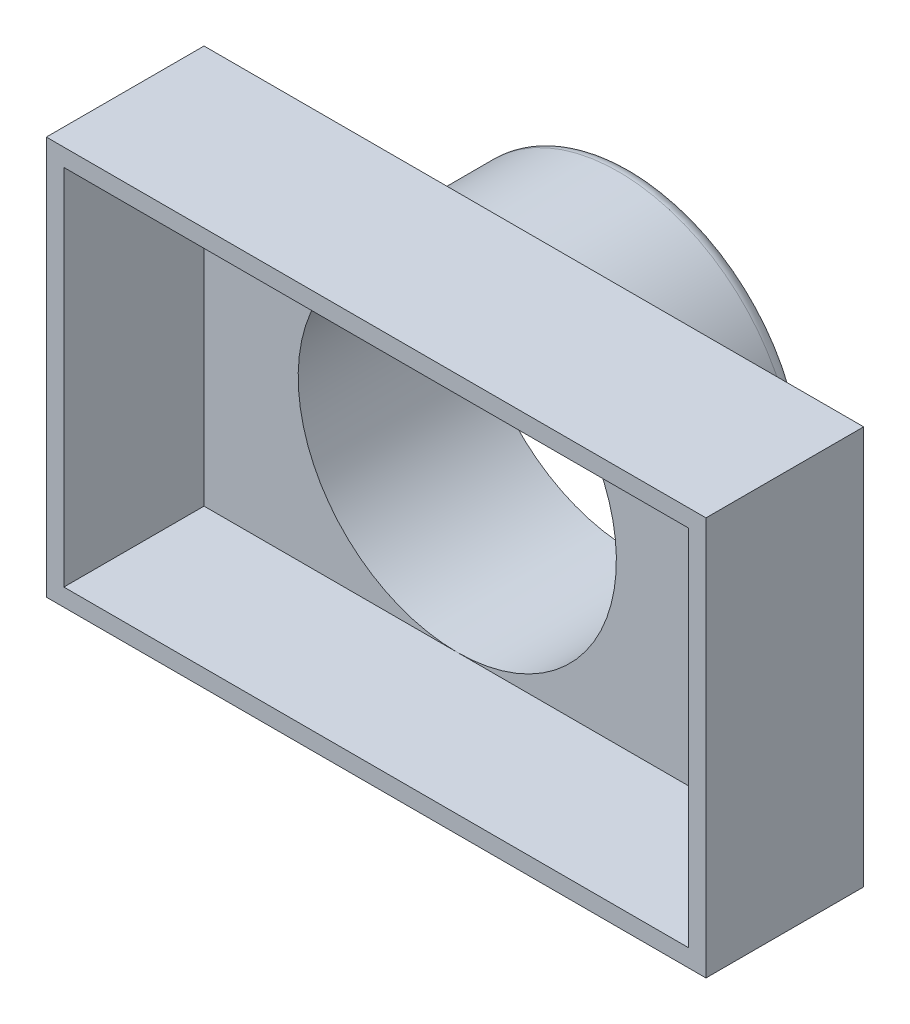
ISO-10303-21;
HEADER;
FILE_DESCRIPTION(('STEP AP214'),'2;1');
FILE_NAME('part.step','',(''),(''),'','','');
FILE_SCHEMA(('AUTOMOTIVE_DESIGN { 1 0 10303 214 1 1 1 1 }'));
ENDSEC;
DATA;
#1=APPLICATION_CONTEXT('core data for automotive mechanical design processes');
#2=APPLICATION_PROTOCOL_DEFINITION('international standard','automotive_design',2000,#1);
#3=PRODUCT_CONTEXT('',#1,'mechanical');
#4=PRODUCT('Part','Part','',(#3));
#5=PRODUCT_RELATED_PRODUCT_CATEGORY('part','',(#4));
#6=PRODUCT_DEFINITION_FORMATION('','',#4);
#7=PRODUCT_DEFINITION_CONTEXT('part definition',#1,'design');
#8=PRODUCT_DEFINITION('design','',#6,#7);
#9=PRODUCT_DEFINITION_SHAPE('','',#8);
#10=(LENGTH_UNIT() NAMED_UNIT(*) SI_UNIT(.MILLI.,.METRE.));
#11=(NAMED_UNIT(*) PLANE_ANGLE_UNIT() SI_UNIT($,.RADIAN.));
#12=(NAMED_UNIT(*) SI_UNIT($,.STERADIAN.) SOLID_ANGLE_UNIT());
#13=UNCERTAINTY_MEASURE_WITH_UNIT(LENGTH_MEASURE(1.E-05),#10,'distance_accuracy_value','');
#14=(GEOMETRIC_REPRESENTATION_CONTEXT(3) GLOBAL_UNCERTAINTY_ASSIGNED_CONTEXT((#13)) GLOBAL_UNIT_ASSIGNED_CONTEXT((#10,
#11,#12)) REPRESENTATION_CONTEXT('',''));
#15=CARTESIAN_POINT('',(0.,0.,0.));
#16=DIRECTION('',(0.,0.,1.));
#17=DIRECTION('',(1.,0.,0.));
#18=AXIS2_PLACEMENT_3D('',#15,#16,#17);
#19=CARTESIAN_POINT('',(0.,0.,-28.575));
#20=DIRECTION('',(0.,0.,-1.));
#21=DIRECTION('',(-1.,0.,0.));
#22=AXIS2_PLACEMENT_3D('',#19,#20,#21);
#23=PLANE('',#22);
#24=DIRECTION('',(-1.,0.,0.));
#25=VECTOR('',#24,1.);
#26=CARTESIAN_POINT('',(0.,-35.30854,-28.575));
#27=LINE('',#26,#25);
#28=CARTESIAN_POINT('',(59.75985,-35.30854,-28.575));
#29=VERTEX_POINT('',#28);
#30=CARTESIAN_POINT('',(12.662727608336,-35.30854,-28.575));
#31=VERTEX_POINT('',#30);
#32=EDGE_CURVE('E132',#29,#31,#27,.T.);
#33=ORIENTED_EDGE('',*,*,#32,.T.);
#34=CARTESIAN_POINT('',(-10.69975,-3.30453999999999,-28.575));
#35=DIRECTION('',(0.,0.,-1.));
#36=DIRECTION('',(-1.,0.,0.));
#37=AXIS2_PLACEMENT_3D('',#34,#35,#36);
#38=CIRCLE('',#37,39.624);
#39=CARTESIAN_POINT('',(-34.062227608336,-35.30854,-28.575));
#40=VERTEX_POINT('',#39);
#41=EDGE_CURVE('E198',#31,#40,#38,.F.);
#42=ORIENTED_EDGE('',*,*,#41,.T.);
#43=CARTESIAN_POINT('',(-59.75985,-35.30854,-28.575));
#44=VERTEX_POINT('',#43);
#45=EDGE_CURVE('E140',#40,#44,#27,.T.);
#46=ORIENTED_EDGE('',*,*,#45,.T.);
#47=DIRECTION('',(0.,1.,0.));
#48=VECTOR('',#47,1.);
#49=CARTESIAN_POINT('',(-59.75985,0.,-28.575));
#50=LINE('',#49,#48);
#51=CARTESIAN_POINT('',(-59.75985,36.89604,-28.575));
#52=VERTEX_POINT('',#51);
#53=EDGE_CURVE('E138',#44,#52,#50,.T.);
#54=ORIENTED_EDGE('',*,*,#53,.T.);
#55=DIRECTION('',(1.,0.,0.));
#56=VECTOR('',#55,1.);
#57=CARTESIAN_POINT('',(0.,36.89604,-28.575));
#58=LINE('',#57,#56);
#59=CARTESIAN_POINT('',(59.75985,36.89604,-28.575));
#60=VERTEX_POINT('',#59);
#61=EDGE_CURVE('E145',#52,#60,#58,.T.);
#62=ORIENTED_EDGE('',*,*,#61,.T.);
#63=DIRECTION('',(0.,-1.,0.));
#64=VECTOR('',#63,1.);
#65=CARTESIAN_POINT('',(59.75985,0.,-28.575));
#66=LINE('',#65,#64);
#67=EDGE_CURVE('E121',#60,#29,#66,.T.);
#68=ORIENTED_EDGE('',*,*,#67,.T.);
#69=EDGE_LOOP('',(#33,#42,#46,#54,#62,#68));
#70=FACE_BOUND('',#69,.T.);
#71=ADVANCED_FACE('F35',(#70),#23,.T.);
#72=CARTESIAN_POINT('',(-59.75985,36.89604,-25.4));
#73=DIRECTION('',(-1.,0.,0.));
#74=DIRECTION('',(0.,-1.,0.));
#75=AXIS2_PLACEMENT_3D('',#72,#73,#74);
#76=PLANE('',#75);
#77=DIRECTION('',(0.,-1.,0.));
#78=VECTOR('',#77,1.);
#79=CARTESIAN_POINT('',(-59.75985,36.89604,0.));
#80=LINE('',#79,#78);
#81=CARTESIAN_POINT('',(-59.75985,36.89604,0.));
#82=VERTEX_POINT('',#81);
#83=CARTESIAN_POINT('',(-59.75985,-35.30854,0.));
#84=VERTEX_POINT('',#83);
#85=EDGE_CURVE('E181',#82,#84,#80,.T.);
#86=ORIENTED_EDGE('',*,*,#85,.F.);
#87=DIRECTION('',(0.,0.,1.));
#88=VECTOR('',#87,1.);
#89=CARTESIAN_POINT('',(-59.75985,36.89604,-25.4));
#90=LINE('',#89,#88);
#91=EDGE_CURVE('E196',#52,#82,#90,.T.);
#92=ORIENTED_EDGE('',*,*,#91,.F.);
#93=ORIENTED_EDGE('',*,*,#53,.F.);
#94=DIRECTION('',(0.,0.,1.));
#95=VECTOR('',#94,1.);
#96=CARTESIAN_POINT('',(-59.75985,-35.30854,-25.4));
#97=LINE('',#96,#95);
#98=EDGE_CURVE('E128',#44,#84,#97,.T.);
#99=ORIENTED_EDGE('',*,*,#98,.T.);
#100=EDGE_LOOP('',(#86,#92,#93,#99));
#101=FACE_BOUND('',#100,.T.);
#102=ADVANCED_FACE('F218',(#101),#76,.T.);
#103=CARTESIAN_POINT('',(-59.75985,36.89604,-25.4));
#104=DIRECTION('',(0.,1.,0.));
#105=DIRECTION('',(0.,0.,1.));
#106=AXIS2_PLACEMENT_3D('',#103,#104,#105);
#107=PLANE('',#106);
#108=DIRECTION('',(-1.,0.,0.));
#109=VECTOR('',#108,1.);
#110=CARTESIAN_POINT('',(-59.75985,36.89604,0.));
#111=LINE('',#110,#109);
#112=CARTESIAN_POINT('',(59.75985,36.89604,0.));
#113=VERTEX_POINT('',#112);
#114=EDGE_CURVE('E193',#113,#82,#111,.T.);
#115=ORIENTED_EDGE('',*,*,#114,.F.);
#116=DIRECTION('',(0.,0.,1.));
#117=VECTOR('',#116,1.);
#118=CARTESIAN_POINT('',(59.75985,36.89604,-25.4));
#119=LINE('',#118,#117);
#120=EDGE_CURVE('E127',#60,#113,#119,.T.);
#121=ORIENTED_EDGE('',*,*,#120,.F.);
#122=ORIENTED_EDGE('',*,*,#61,.F.);
#123=ORIENTED_EDGE('',*,*,#91,.T.);
#124=EDGE_LOOP('',(#115,#121,#122,#123));
#125=FACE_BOUND('',#124,.T.);
#126=ADVANCED_FACE('F287',(#125),#107,.T.);
#127=CARTESIAN_POINT('',(59.75985,36.89604,-25.4));
#128=DIRECTION('',(1.,0.,0.));
#129=DIRECTION('',(0.,1.,0.));
#130=AXIS2_PLACEMENT_3D('',#127,#128,#129);
#131=PLANE('',#130);
#132=DIRECTION('',(0.,1.,0.));
#133=VECTOR('',#132,1.);
#134=CARTESIAN_POINT('',(59.75985,36.89604,0.));
#135=LINE('',#134,#133);
#136=CARTESIAN_POINT('',(59.75985,-35.30854,0.));
#137=VERTEX_POINT('',#136);
#138=EDGE_CURVE('E123',#137,#113,#135,.T.);
#139=ORIENTED_EDGE('',*,*,#138,.F.);
#140=DIRECTION('',(0.,0.,1.));
#141=VECTOR('',#140,1.);
#142=CARTESIAN_POINT('',(59.75985,-35.30854,-25.4));
#143=LINE('',#142,#141);
#144=EDGE_CURVE('E117',#29,#137,#143,.T.);
#145=ORIENTED_EDGE('',*,*,#144,.F.);
#146=ORIENTED_EDGE('',*,*,#67,.F.);
#147=ORIENTED_EDGE('',*,*,#120,.T.);
#148=EDGE_LOOP('',(#139,#145,#146,#147));
#149=FACE_BOUND('',#148,.T.);
#150=ADVANCED_FACE('F119',(#149),#131,.T.);
#151=CARTESIAN_POINT('',(-59.75985,-35.30854,-25.4));
#152=DIRECTION('',(0.,-1.,0.));
#153=DIRECTION('',(1.,0.,0.));
#154=AXIS2_PLACEMENT_3D('',#151,#152,#153);
#155=PLANE('',#154);
#156=CARTESIAN_POINT('',(-10.69975,-35.30854,-28.575));
#157=VERTEX_POINT('',#156);
#158=EDGE_CURVE('E141',#157,#40,#27,.T.);
#159=ORIENTED_EDGE('',*,*,#158,.F.);
#160=EDGE_CURVE('E136',#31,#157,#27,.T.);
#161=ORIENTED_EDGE('',*,*,#160,.F.);
#162=ORIENTED_EDGE('',*,*,#32,.F.);
#163=ORIENTED_EDGE('',*,*,#144,.T.);
#164=DIRECTION('',(1.,0.,0.));
#165=VECTOR('',#164,1.);
#166=CARTESIAN_POINT('',(-59.75985,-35.30854,0.));
#167=LINE('',#166,#165);
#168=EDGE_CURVE('E190',#84,#137,#167,.T.);
#169=ORIENTED_EDGE('',*,*,#168,.F.);
#170=ORIENTED_EDGE('',*,*,#98,.F.);
#171=ORIENTED_EDGE('',*,*,#45,.F.);
#172=EDGE_LOOP('',(#159,#161,#162,#163,#169,#170,#171));
#173=FACE_BOUND('',#172,.T.);
#174=ADVANCED_FACE('F134',(#173),#155,.T.);
#175=CARTESIAN_POINT('',(0.,0.,0.));
#176=DIRECTION('',(0.,0.,1.));
#177=DIRECTION('',(1.,0.,0.));
#178=AXIS2_PLACEMENT_3D('',#175,#176,#177);
#179=PLANE('',#178);
#180=DIRECTION('',(0.,1.,0.));
#181=VECTOR('',#180,1.);
#182=CARTESIAN_POINT('',(56.58485,33.72104,0.));
#183=LINE('',#182,#181);
#184=CARTESIAN_POINT('',(56.58485,-32.13354,0.));
#185=VERTEX_POINT('',#184);
#186=CARTESIAN_POINT('',(56.58485,33.72104,0.));
#187=VERTEX_POINT('',#186);
#188=EDGE_CURVE('E154',#185,#187,#183,.T.);
#189=ORIENTED_EDGE('',*,*,#188,.F.);
#190=DIRECTION('',(1.,0.,0.));
#191=VECTOR('',#190,1.);
#192=CARTESIAN_POINT('',(-56.58485,-32.13354,0.));
#193=LINE('',#192,#191);
#194=CARTESIAN_POINT('',(-56.58485,-32.13354,0.));
#195=VERTEX_POINT('',#194);
#196=EDGE_CURVE('E160',#195,#185,#193,.T.);
#197=ORIENTED_EDGE('',*,*,#196,.F.);
#198=DIRECTION('',(0.,-1.,0.));
#199=VECTOR('',#198,1.);
#200=CARTESIAN_POINT('',(-56.58485,33.72104,0.));
#201=LINE('',#200,#199);
#202=CARTESIAN_POINT('',(-56.58485,33.72104,0.));
#203=VERTEX_POINT('',#202);
#204=EDGE_CURVE('E174',#203,#195,#201,.T.);
#205=ORIENTED_EDGE('',*,*,#204,.F.);
#206=DIRECTION('',(-1.,0.,0.));
#207=VECTOR('',#206,1.);
#208=CARTESIAN_POINT('',(-56.58485,33.72104,0.));
#209=LINE('',#208,#207);
#210=EDGE_CURVE('E171',#187,#203,#209,.T.);
#211=ORIENTED_EDGE('',*,*,#210,.F.);
#212=EDGE_LOOP('',(#189,#197,#205,#211));
#213=FACE_BOUND('',#212,.T.);
#214=ORIENTED_EDGE('',*,*,#85,.T.);
#215=ORIENTED_EDGE('',*,*,#168,.T.);
#216=ORIENTED_EDGE('',*,*,#138,.T.);
#217=ORIENTED_EDGE('',*,*,#114,.T.);
#218=EDGE_LOOP('',(#214,#215,#216,#217));
#219=FACE_BOUND('',#218,.T.);
#220=ADVANCED_FACE('F314',(#213,#219),#179,.T.);
#221=CARTESIAN_POINT('',(56.58485,33.72104,-25.4));
#222=DIRECTION('',(1.,0.,0.));
#223=DIRECTION('',(0.,1.,0.));
#224=AXIS2_PLACEMENT_3D('',#221,#222,#223);
#225=PLANE('',#224);
#226=ORIENTED_EDGE('',*,*,#188,.T.);
#227=DIRECTION('',(0.,0.,1.));
#228=VECTOR('',#227,1.);
#229=CARTESIAN_POINT('',(56.58485,33.72104,-25.4));
#230=LINE('',#229,#228);
#231=CARTESIAN_POINT('',(56.58485,33.72104,-25.4));
#232=VERTEX_POINT('',#231);
#233=EDGE_CURVE('E169',#232,#187,#230,.T.);
#234=ORIENTED_EDGE('',*,*,#233,.F.);
#235=DIRECTION('',(0.,1.,0.));
#236=VECTOR('',#235,1.);
#237=CARTESIAN_POINT('',(56.58485,33.72104,-25.4));
#238=LINE('',#237,#236);
#239=CARTESIAN_POINT('',(56.58485,-32.13354,-25.4));
#240=VERTEX_POINT('',#239);
#241=EDGE_CURVE('E156',#240,#232,#238,.T.);
#242=ORIENTED_EDGE('',*,*,#241,.F.);
#243=DIRECTION('',(0.,0.,1.));
#244=VECTOR('',#243,1.);
#245=CARTESIAN_POINT('',(56.58485,-32.13354,-25.4));
#246=LINE('',#245,#244);
#247=EDGE_CURVE('E179',#240,#185,#246,.T.);
#248=ORIENTED_EDGE('',*,*,#247,.T.);
#249=EDGE_LOOP('',(#226,#234,#242,#248));
#250=FACE_BOUND('',#249,.T.);
#251=ADVANCED_FACE('F304',(#250),#225,.F.);
#252=CARTESIAN_POINT('',(-56.58485,-32.13354,-25.4));
#253=DIRECTION('',(0.,-1.,0.));
#254=DIRECTION('',(0.,0.,-1.));
#255=AXIS2_PLACEMENT_3D('',#252,#253,#254);
#256=PLANE('',#255);
#257=ORIENTED_EDGE('',*,*,#196,.T.);
#258=ORIENTED_EDGE('',*,*,#247,.F.);
#259=DIRECTION('',(1.,0.,0.));
#260=VECTOR('',#259,1.);
#261=CARTESIAN_POINT('',(-56.58485,-32.13354,-25.4));
#262=LINE('',#261,#260);
#263=CARTESIAN_POINT('',(-10.69975,-32.13354,-25.4));
#264=VERTEX_POINT('',#263);
#265=EDGE_CURVE('E166',#264,#240,#262,.T.);
#266=ORIENTED_EDGE('',*,*,#265,.F.);
#267=CARTESIAN_POINT('',(-56.58485,-32.13354,-25.4));
#268=VERTEX_POINT('',#267);
#269=EDGE_CURVE('E167',#268,#264,#262,.T.);
#270=ORIENTED_EDGE('',*,*,#269,.F.);
#271=DIRECTION('',(0.,0.,1.));
#272=VECTOR('',#271,1.);
#273=CARTESIAN_POINT('',(-56.58485,-32.13354,-25.4));
#274=LINE('',#273,#272);
#275=EDGE_CURVE('E182',#268,#195,#274,.T.);
#276=ORIENTED_EDGE('',*,*,#275,.T.);
#277=EDGE_LOOP('',(#257,#258,#266,#270,#276));
#278=FACE_BOUND('',#277,.T.);
#279=ADVANCED_FACE('F300',(#278),#256,.F.);
#280=CARTESIAN_POINT('',(-56.58485,33.72104,-25.4));
#281=DIRECTION('',(-1.,0.,0.));
#282=DIRECTION('',(0.,-1.,0.));
#283=AXIS2_PLACEMENT_3D('',#280,#281,#282);
#284=PLANE('',#283);
#285=ORIENTED_EDGE('',*,*,#204,.T.);
#286=ORIENTED_EDGE('',*,*,#275,.F.);
#287=DIRECTION('',(0.,-1.,0.));
#288=VECTOR('',#287,1.);
#289=CARTESIAN_POINT('',(-56.58485,33.72104,-25.4));
#290=LINE('',#289,#288);
#291=CARTESIAN_POINT('',(-56.58485,33.72104,-25.4));
#292=VERTEX_POINT('',#291);
#293=EDGE_CURVE('E163',#292,#268,#290,.T.);
#294=ORIENTED_EDGE('',*,*,#293,.F.);
#295=DIRECTION('',(0.,0.,1.));
#296=VECTOR('',#295,1.);
#297=CARTESIAN_POINT('',(-56.58485,33.72104,-25.4));
#298=LINE('',#297,#296);
#299=EDGE_CURVE('E184',#292,#203,#298,.T.);
#300=ORIENTED_EDGE('',*,*,#299,.T.);
#301=EDGE_LOOP('',(#285,#286,#294,#300));
#302=FACE_BOUND('',#301,.T.);
#303=ADVANCED_FACE('F303',(#302),#284,.F.);
#304=CARTESIAN_POINT('',(-56.58485,33.72104,-25.4));
#305=DIRECTION('',(0.,1.,0.));
#306=DIRECTION('',(0.,0.,1.));
#307=AXIS2_PLACEMENT_3D('',#304,#305,#306);
#308=PLANE('',#307);
#309=ORIENTED_EDGE('',*,*,#210,.T.);
#310=ORIENTED_EDGE('',*,*,#299,.F.);
#311=DIRECTION('',(-1.,0.,0.));
#312=VECTOR('',#311,1.);
#313=CARTESIAN_POINT('',(-56.58485,33.72104,-25.4));
#314=LINE('',#313,#312);
#315=EDGE_CURVE('E159',#232,#292,#314,.T.);
#316=ORIENTED_EDGE('',*,*,#315,.F.);
#317=ORIENTED_EDGE('',*,*,#233,.T.);
#318=EDGE_LOOP('',(#309,#310,#316,#317));
#319=FACE_BOUND('',#318,.T.);
#320=ADVANCED_FACE('F295',(#319),#308,.F.);
#321=CARTESIAN_POINT('',(0.,0.,-25.4));
#322=DIRECTION('',(0.,0.,-1.));
#323=DIRECTION('',(-1.,0.,0.));
#324=AXIS2_PLACEMENT_3D('',#321,#322,#323);
#325=PLANE('',#324);
#326=ORIENTED_EDGE('',*,*,#265,.T.);
#327=ORIENTED_EDGE('',*,*,#241,.T.);
#328=ORIENTED_EDGE('',*,*,#315,.T.);
#329=ORIENTED_EDGE('',*,*,#293,.T.);
#330=ORIENTED_EDGE('',*,*,#269,.T.);
#331=CARTESIAN_POINT('',(-10.69975,-3.30453999999999,-25.4));
#332=DIRECTION('',(0.,0.,-1.));
#333=DIRECTION('',(-1.,0.,0.));
#334=AXIS2_PLACEMENT_3D('',#331,#332,#333);
#335=CIRCLE('',#334,28.829);
#336=EDGE_CURVE('E146',#264,#264,#335,.T.);
#337=ORIENTED_EDGE('',*,*,#336,.T.);
#338=EDGE_LOOP('',(#326,#327,#328,#329,#330,#337));
#339=FACE_BOUND('',#338,.T.);
#340=ADVANCED_FACE('F291',(#339),#325,.F.);
#341=CARTESIAN_POINT('',(-10.69975,-3.30453999999999,-28.575));
#342=DIRECTION('',(0.,0.,1.));
#343=DIRECTION('',(1.,0.,0.));
#344=AXIS2_PLACEMENT_3D('',#341,#342,#343);
#345=CYLINDRICAL_SURFACE('',#344,28.829);
#346=ORIENTED_EDGE('',*,*,#336,.F.);
#347=EDGE_LOOP('',(#346));
#348=FACE_BOUND('',#347,.T.);
#349=CARTESIAN_POINT('',(-10.69975,-3.30453999999999,-57.15));
#350=DIRECTION('',(0.,0.,-1.));
#351=DIRECTION('',(-1.,0.,0.));
#352=AXIS2_PLACEMENT_3D('',#349,#350,#351);
#353=CIRCLE('',#352,28.829);
#354=CARTESIAN_POINT('',(-39.52875,-3.30453999999999,-57.15));
#355=VERTEX_POINT('',#354);
#356=EDGE_CURVE('E149',#355,#355,#353,.T.);
#357=ORIENTED_EDGE('',*,*,#356,.T.);
#358=EDGE_LOOP('',(#357));
#359=FACE_BOUND('',#358,.T.);
#360=ADVANCED_FACE('F276',(#348,#359),#345,.F.);
#361=CARTESIAN_POINT('',(-10.69975,-3.30453999999999,-57.15));
#362=DIRECTION('',(0.,0.,1.));
#363=DIRECTION('',(1.,0.,0.));
#364=AXIS2_PLACEMENT_3D('',#361,#362,#363);
#365=CYLINDRICAL_SURFACE('',#364,32.004);
#366=CARTESIAN_POINT('',(-10.69975,-3.30453999999999,-54.61));
#367=DIRECTION('',(0.,0.,-1.));
#368=DIRECTION('',(-1.,0.,0.));
#369=AXIS2_PLACEMENT_3D('',#366,#367,#368);
#370=CIRCLE('',#369,32.004);
#371=CARTESIAN_POINT('',(-42.70375,-3.30453999999999,-54.61));
#372=VERTEX_POINT('',#371);
#373=EDGE_CURVE('E11',#372,#372,#370,.F.);
#374=ORIENTED_EDGE('',*,*,#373,.T.);
#375=EDGE_LOOP('',(#374));
#376=FACE_BOUND('',#375,.T.);
#377=CARTESIAN_POINT('',(11.227041113575,-26.6170226533265,-35.5175486935853));
#378=CARTESIAN_POINT('',(8.9869193015085,-28.7239918583046,-25.5960392549932));
#379=CARTESIAN_POINT('',(16.4477056644262,-35.30854,-28.575));
#380=CARTESIAN_POINT('',(10.9982886497885,-26.832260708099,-35.6379884870951));
#381=CARTESIAN_POINT('',(9.023304991951,-28.6490320066552,-25.8624796757207));
#382=CARTESIAN_POINT('',(16.1644883284576,-35.30854,-28.575));
#383=CARTESIAN_POINT('',(10.7631689985095,-27.0469786738486,-35.7399191862714));
#384=CARTESIAN_POINT('',(9.03071892401267,-28.609283265864,-26.1346991350556));
#385=CARTESIAN_POINT('',(15.8733878078397,-35.30854,-28.575));
#386=CARTESIAN_POINT('',(10.2826737739935,-27.4726110874492,-35.9104042171271));
#387=CARTESIAN_POINT('',(8.99093122672649,-28.5903672231225,-26.6670069019776));
#388=CARTESIAN_POINT('',(15.2784889583781,-35.30854,-28.575));
#389=CARTESIAN_POINT('',(10.0373198299773,-27.6835323299193,-35.9790254145113));
#390=CARTESIAN_POINT('',(8.94547355120624,-28.6092652451311,-26.9274844897984));
#391=CARTESIAN_POINT('',(14.9747174085699,-35.30854,-28.575));
#392=CARTESIAN_POINT('',(9.54046781834519,-28.0975515466675,-36.0864320563779));
#393=CARTESIAN_POINT('',(8.80772400493284,-28.6927882349179,-27.4228611876201));
#394=CARTESIAN_POINT('',(14.3595672988773,-35.30854,-28.575));
#395=CARTESIAN_POINT('',(9.28905904883305,-28.3007077190126,-36.1255174885602));
#396=CARTESIAN_POINT('',(8.71722267046446,-28.7556698689595,-27.6586836689458));
#397=CARTESIAN_POINT('',(14.0482992985488,-35.30854,-28.575));
#398=CARTESIAN_POINT('',(8.77898951766228,-28.7002037043267,-36.1783370982007));
#399=CARTESIAN_POINT('',(8.49668308603599,-28.9144074968741,-28.1030443961924));
#400=CARTESIAN_POINT('',(13.4167846409231,-35.30854,-28.575));
#401=CARTESIAN_POINT('',(8.52032393202501,-28.8965387791212,-36.1920539861013));
#402=CARTESIAN_POINT('',(8.36758288425515,-29.0094717793521,-28.3124517341761));
#403=CARTESIAN_POINT('',(13.0965320110808,-35.30854,-28.575));
#404=CARTESIAN_POINT('',(7.84482150842379,-29.3932061289335,-36.1985623570766));
#405=CARTESIAN_POINT('',(7.99388251596697,-29.282645943869,-28.8114436752308));
#406=CARTESIAN_POINT('',(12.2601956770926,-35.30854,-28.575));
#407=CARTESIAN_POINT('',(7.42349037107773,-29.6876091927732,-36.1745431878565));
#408=CARTESIAN_POINT('',(7.72365010471418,-29.4785618533907,-29.0854618024638));
#409=CARTESIAN_POINT('',(11.7385476022883,-35.30854,-28.575));
#410=CARTESIAN_POINT('',(6.56955913741692,-30.2543078174086,-36.0805731248419));
#411=CARTESIAN_POINT('',(7.11942091259478,-29.8989218683562,-29.5604772719553));
#412=CARTESIAN_POINT('',(10.6812994082336,-35.30854,-28.575));
#413=CARTESIAN_POINT('',(6.13695509180715,-30.5265954890472,-36.0106059203058));
#414=CARTESIAN_POINT('',(6.78686099819554,-30.1229056675244,-29.7645399762343));
#415=CARTESIAN_POINT('',(10.1456943993797,-35.30854,-28.575));
#416=CARTESIAN_POINT('',(5.26015452742731,-31.0498063728425,-35.8322896697617));
#417=CARTESIAN_POINT('',(6.07150269346981,-30.5811349006122,-30.1083506500085));
#418=CARTESIAN_POINT('',(9.06013179586301,-35.30854,-28.575));
#419=CARTESIAN_POINT('',(4.81589987536725,-31.3005747228608,-35.7236873590222));
#420=CARTESIAN_POINT('',(5.68888628870684,-30.8157953127028,-30.250156362941));
#421=CARTESIAN_POINT('',(8.51010222665079,-35.30854,-28.575));
#422=CARTESIAN_POINT('',(3.92059542861604,-31.7783720295346,-35.4749455685291));
#423=CARTESIAN_POINT('',(4.88709001958795,-31.2809687869954,-30.4765683697697));
#424=CARTESIAN_POINT('',(7.40163005447281,-35.30854,-28.575));
#425=CARTESIAN_POINT('',(3.4695457624405,-32.0054014345267,-35.3348066845367));
#426=CARTESIAN_POINT('',(4.46787999988489,-31.5121831669457,-30.5630039329228));
#427=CARTESIAN_POINT('',(6.84318761062161,-35.30854,-28.575));
#428=CARTESIAN_POINT('',(2.29071655023756,-32.564539159406,-34.9369887992613));
#429=CARTESIAN_POINT('',(3.35067311179378,-32.0922696922945,-30.7235148641893));
#430=CARTESIAN_POINT('',(5.38368477651499,-35.30854,-28.575));
#431=CARTESIAN_POINT('',(1.5586548286697,-32.8783581604739,-34.6591169611698));
#432=CARTESIAN_POINT('',(2.62155526049106,-32.4383228093304,-30.7653515800499));
#433=CARTESIAN_POINT('',(4.47732264516674,-35.30854,-28.575));
#434=CARTESIAN_POINT('',(0.0847204847687094,-33.4471346759545,-34.0546231981709));
#435=CARTESIAN_POINT('',(1.11845953827166,-33.0772401987046,-30.7557250666684));
#436=CARTESIAN_POINT('',(2.6524515527221,-35.30854,-28.575));
#437=CARTESIAN_POINT('',(-0.657157987629239,-33.702055251286,-33.7279708900765));
#438=CARTESIAN_POINT('',(0.341238323008967,-33.3735765371024,-30.7069358074484));
#439=CARTESIAN_POINT('',(1.73393534868815,-35.30854,-28.575));
#440=CARTESIAN_POINT('',(-2.14663544083341,-34.1542594796681,-33.0397238576477));
#441=CARTESIAN_POINT('',(-1.24031080925881,-33.9038483221145,-30.542430151057));
#442=CARTESIAN_POINT('',(-0.110179593451371,-35.30854,-28.575));
#443=CARTESIAN_POINT('',(-2.89422635336055,-34.3516129571069,-32.6781721782728));
#444=CARTESIAN_POINT('',(-2.048452631383,-34.1407773011496,-30.4278547675811));
#445=CARTESIAN_POINT('',(-1.03576834225921,-35.30854,-28.575));
#446=CARTESIAN_POINT('',(-4.39356535547241,-34.6905011928993,-31.9305392535515));
#447=CARTESIAN_POINT('',(-3.68112316963505,-34.5488025041928,-30.1527509056198));
#448=CARTESIAN_POINT('',(-2.89209282104637,-35.30854,-28.575));
#449=CARTESIAN_POINT('',(-5.14531164856609,-34.8320584110248,-31.5444679509481));
#450=CARTESIAN_POINT('',(-4.50982387411741,-34.7221395308309,-29.9922595140125));
#451=CARTESIAN_POINT('',(-3.82282632679868,-35.30854,-28.575));
#452=CARTESIAN_POINT('',(-6.69217939943077,-35.0667817733733,-30.7352557391217));
#453=CARTESIAN_POINT('',(-6.22007070649482,-35.0091986712443,-29.6331474278114));
#454=CARTESIAN_POINT('',(-5.73799592310206,-35.30854,-28.575));
#455=CARTESIAN_POINT('',(-7.48745575325099,-35.156930000834,-30.3112382810949));
#456=CARTESIAN_POINT('',(-7.10753211459771,-35.1209888727494,-29.4321301677848));
#457=CARTESIAN_POINT('',(-6.72262378971187,-35.30854,-28.575));
#458=CARTESIAN_POINT('',(-9.07867388074093,-35.2774004589675,-29.4551050062766));
#459=CARTESIAN_POINT('',(-8.88312109900085,-35.2697200051631,-29.0156079735819));
#460=CARTESIAN_POINT('',(-8.69270337612922,-35.30854,-28.575));
#461=CARTESIAN_POINT('',(-9.87461370622288,-35.3077944548524,-29.0229995339805));
#462=CARTESIAN_POINT('',(-9.77635195329678,-35.3076143469202,-28.7990065258284));
#463=CARTESIAN_POINT('',(-9.67815268389468,-35.30854,-28.575));
#464=CARTESIAN_POINT('',(-10.6801178060279,-35.3085354820251,-28.5856591160001));
#465=CARTESIAN_POINT('',(-10.6777806358762,-35.3085344379586,-28.5803295596458));
#466=CARTESIAN_POINT('',(-10.6754434741298,-35.30854,-28.575));
#467=CARTESIAN_POINT('',(-10.6899339231774,-35.3085399980662,-28.5803295466763));
#468=CARTESIAN_POINT('',(-10.6887653432251,-35.3085400300437,-28.5776647738275));
#469=CARTESIAN_POINT('',(-10.6875967620292,-35.30854,-28.575));
#470=CARTESIAN_POINT('',(-10.69975,-35.30854,-28.575));
#471=CARTESIAN_POINT('',(-10.69975,-35.30854,-28.575));
#472=CARTESIAN_POINT('',(-10.69975,-35.30854,-28.575));
#473=(BOUNDED_SURFACE() B_SPLINE_SURFACE(3,2,((#377,#378,#379),(#380,#381,#382),(#383,#384,
#385),(#386,#387,#388),(#389,#390,#391),(#392,#393,#394),(#395,#396,#397),(#398,#399,#400),
(#401,#402,#403),(#404,#405,#406),(#407,#408,#409),(#410,#411,#412),(#413,#414,#415),(#416,#417,
#418),(#419,#420,#421),(#422,#423,#424),(#425,#426,#427),(#428,#429,#430),(#431,#432,#433),
(#434,#435,#436),(#437,#438,#439),(#440,#441,#442),(#443,#444,#445),(#446,#447,#448),(#449,#450,
#451),(#452,#453,#454),(#455,#456,#457),(#458,#459,#460),(#461,#462,#463),(#464,#465,#466),
(#467,#468,#469),(#470,#471,#472)),.UNSPECIFIED.,.F.,.F.,.F.) B_SPLINE_SURFACE_WITH_KNOTS((4,2,
2,2,2,2,2,2,2,2,2,2,2,2,2,4),(3,3),(0.,1.22021395049847,2.43796820062457,3.64318131858074,
4.84921552952165,6.75669827253836,8.66485850454592,10.5857650499619,12.5066353103444,
15.5754919148094,18.6462680082553,21.7133038534566,24.7791038551388,28.0100726574236,
31.2371586693561,31.2769702290012),(0.,1.),
.UNSPECIFIED.) GEOMETRIC_REPRESENTATION_ITEM() RATIONAL_B_SPLINE_SURFACE(((1.,0.591501151566438,
1.),(1.,0.601096161132818,1.),(1.,0.610733015670685,1.),(1.,0.629944959072105,1.),(1.,
0.639520133283899,1.),(1.,0.658405210370189,1.),(1.,0.6677168296122,1.),(1.,0.686100627155283,
1.),(1.,0.695172638006983,1.),(1.,0.718199214151137,1.),(1.,0.731924698286597,1.),(1.,
0.758451980087056,1.),(1.,0.771253447950836,1.),(1.,0.795929708621105,1.),(1.,0.807797740119287,
1.),(1.,0.830467030936563,1.),(1.,0.841268310402254,1.),(1.,0.86792259339922,1.),(1.,
0.882936788224892,1.),(1.,0.910205973622674,1.),(1.,0.922459232511381,1.),(1.,0.944226610231245,
1.),(1.,0.953744047194894,1.),(1.,0.970102391578414,1.),(1.,0.976944375944367,1.),(1.,
0.98829553715819,1.),(1.,0.992659176210603,1.),(1.,0.99849161589368,1.),(1.,0.999963889070864,
1.),(1.,0.9999997812262,1.),(1.,0.999999999945567,1.),(1.,1.,1.))) REPRESENTATION_ITEM('') SURFACE());
#474=CARTESIAN_POINT('',(11.227041113575,-26.6170226533265,-35.5175486935853));
#475=CARTESIAN_POINT('',(10.9982886497885,-26.832260708099,-35.6379884870951));
#476=CARTESIAN_POINT('',(10.7631689985095,-27.0469786738486,-35.7399191862714));
#477=CARTESIAN_POINT('',(10.2826737739935,-27.4726110874492,-35.9104042171271));
#478=CARTESIAN_POINT('',(10.0373198299773,-27.6835323299193,-35.9790254145113));
#479=CARTESIAN_POINT('',(9.54046781834519,-28.0975515466675,-36.0864320563779));
#480=CARTESIAN_POINT('',(9.28905904883305,-28.3007077190126,-36.1255174885602));
#481=CARTESIAN_POINT('',(8.77898951766228,-28.7002037043267,-36.1783370982007));
#482=CARTESIAN_POINT('',(8.52032393202501,-28.8965387791212,-36.1920539861013));
#483=CARTESIAN_POINT('',(7.84482150842379,-29.3932061289335,-36.1985623570766));
#484=CARTESIAN_POINT('',(7.42349037107773,-29.6876091927732,-36.1745431878565));
#485=CARTESIAN_POINT('',(6.56955913741692,-30.2543078174086,-36.0805731248419));
#486=CARTESIAN_POINT('',(6.13695509180715,-30.5265954890472,-36.0106059203058));
#487=CARTESIAN_POINT('',(5.26015452742731,-31.0498063728425,-35.8322896697617));
#488=CARTESIAN_POINT('',(4.81589987536725,-31.3005747228608,-35.7236873590222));
#489=CARTESIAN_POINT('',(3.92059542861604,-31.7783720295346,-35.4749455685291));
#490=CARTESIAN_POINT('',(3.4695457624405,-32.0054014345267,-35.3348066845367));
#491=CARTESIAN_POINT('',(2.29071655023756,-32.564539159406,-34.9369887992613));
#492=CARTESIAN_POINT('',(1.5586548286697,-32.8783581604739,-34.6591169611698));
#493=CARTESIAN_POINT('',(0.0847204847687093,-33.4471346759545,-34.0546231981709));
#494=CARTESIAN_POINT('',(-0.657157987629238,-33.702055251286,-33.7279708900765));
#495=CARTESIAN_POINT('',(-2.14663544083341,-34.1542594796681,-33.0397238576477));
#496=CARTESIAN_POINT('',(-2.89422635336055,-34.3516129571069,-32.6781721782728));
#497=CARTESIAN_POINT('',(-4.39356535547241,-34.6905011928993,-31.9305392535515));
#498=CARTESIAN_POINT('',(-5.14531164856609,-34.8320584110248,-31.5444679509481));
#499=CARTESIAN_POINT('',(-6.69217939943078,-35.0667817733733,-30.7352557391217));
#500=CARTESIAN_POINT('',(-7.48745575325101,-35.156930000834,-30.3112382810949));
#501=CARTESIAN_POINT('',(-9.07867388074092,-35.2774004589676,-29.4551050062766));
#502=CARTESIAN_POINT('',(-9.8746137062228,-35.3077944548525,-29.0229995339805));
#503=CARTESIAN_POINT('',(-10.6801178060279,-35.3085354820251,-28.5856591160001));
#504=CARTESIAN_POINT('',(-10.6899339231774,-35.3085399980662,-28.5803295466763));
#505=CARTESIAN_POINT('',(-10.69975,-35.30854,-28.575));
#506=B_SPLINE_CURVE_WITH_KNOTS('',3,(#474,#475,#476,#477,#478,#479,#480,#481,#482,#483,#484,
#485,#486,#487,#488,#489,#490,#491,#492,#493,#494,#495,#496,#497,#498,#499,#500,#501,#502,#503,
#504,#505),.UNSPECIFIED.,.F.,.F.,(4,2,2,2,2,2,2,2,2,2,2,2,2,2,2,4),(0.,1.22021395049847,
2.43796820062457,3.64318131858074,4.84921552952165,6.75669827253836,8.66485850454592,
10.5857650499619,12.5066353103444,15.5754919148094,18.6462680082553,21.7133038534566,
24.7791038551388,28.0100726574236,31.2371586693561,31.2769702290012),.UNSPECIFIED.);
#507=CARTESIAN_POINT('',(8.16994345288674,-29.1539246153846,-36.195));
#508=VERTEX_POINT('',#507);
#509=EDGE_CURVE('E202',#508,#157,#506,.T.);
#510=ORIENTED_EDGE('',*,*,#509,.T.);
#511=CARTESIAN_POINT('',(-37.847205664426,-35.30854,-28.575));
#512=CARTESIAN_POINT('',(-30.3864193015085,-28.7239918583045,-25.5960392549934));
#513=CARTESIAN_POINT('',(-32.6265411135749,-26.6170226533266,-35.5175486935854));
#514=CARTESIAN_POINT('',(-37.5639883284575,-35.30854,-28.575));
#515=CARTESIAN_POINT('',(-30.422804991951,-28.6490320066551,-25.8624796757209));
#516=CARTESIAN_POINT('',(-32.3977886497884,-26.8322607080992,-35.6379884870952));
#517=CARTESIAN_POINT('',(-37.2728878078396,-35.30854,-28.575));
#518=CARTESIAN_POINT('',(-30.4302189240127,-28.609283265864,-26.1346991350558));
#519=CARTESIAN_POINT('',(-32.1626689985094,-27.0469786738487,-35.7399191862714));
#520=CARTESIAN_POINT('',(-36.6779889583779,-35.30854,-28.575));
#521=CARTESIAN_POINT('',(-30.3904312267265,-28.5903672231225,-26.6670069019778));
#522=CARTESIAN_POINT('',(-31.6821737739933,-27.4726110874493,-35.9104042171272));
#523=CARTESIAN_POINT('',(-36.3742174085697,-35.30854,-28.575));
#524=CARTESIAN_POINT('',(-30.3449735512062,-28.6092652451311,-26.9274844897986));
#525=CARTESIAN_POINT('',(-31.4368198299771,-27.6835323299195,-35.9790254145114));
#526=CARTESIAN_POINT('',(-35.759067298877,-35.30854,-28.575));
#527=CARTESIAN_POINT('',(-30.2072240049328,-28.692788234918,-27.4228611876202));
#528=CARTESIAN_POINT('',(-30.939967818345,-28.0975515466677,-36.086432056378));
#529=CARTESIAN_POINT('',(-35.4477992985486,-35.30854,-28.575));
#530=CARTESIAN_POINT('',(-30.1167226704644,-28.7556698689596,-27.658683668946));
#531=CARTESIAN_POINT('',(-30.6885590488328,-28.3007077190128,-36.1255174885603));
#532=CARTESIAN_POINT('',(-34.8162846409228,-35.30854,-28.575));
#533=CARTESIAN_POINT('',(-29.8961830860359,-28.9144074968742,-28.1030443961926));
#534=CARTESIAN_POINT('',(-30.1784895176621,-28.7002037043269,-36.1783370982008));
#535=CARTESIAN_POINT('',(-34.4960320110805,-35.30854,-28.575));
#536=CARTESIAN_POINT('',(-29.767082884255,-29.0094717793522,-28.3124517341763));
#537=CARTESIAN_POINT('',(-29.9198239320248,-28.8965387791214,-36.1920539861013));
#538=CARTESIAN_POINT('',(-33.6596956770923,-35.30854,-28.575));
#539=CARTESIAN_POINT('',(-29.3933825159668,-29.2826459438691,-28.811443675231));
#540=CARTESIAN_POINT('',(-29.2443215084235,-29.3932061289337,-36.1985623570766));
#541=CARTESIAN_POINT('',(-33.138047602288,-35.30854,-28.575));
#542=CARTESIAN_POINT('',(-29.123150104714,-29.4785618533909,-29.085461802464));
#543=CARTESIAN_POINT('',(-28.8229903710774,-29.6876091927734,-36.1745431878565));
#544=CARTESIAN_POINT('',(-32.0807994082331,-35.30854,-28.575));
#545=CARTESIAN_POINT('',(-28.5189209125945,-29.8989218683563,-29.5604772719554));
#546=CARTESIAN_POINT('',(-27.9690591374166,-30.2543078174088,-36.0805731248418));
#547=CARTESIAN_POINT('',(-31.5451943993792,-35.30854,-28.575));
#548=CARTESIAN_POINT('',(-28.1863609981953,-30.1229056675245,-29.7645399762344));
#549=CARTESIAN_POINT('',(-27.5364550918068,-30.5265954890475,-36.0106059203057));
#550=CARTESIAN_POINT('',(-30.4596317958625,-35.30854,-28.575));
#551=CARTESIAN_POINT('',(-27.4710026934695,-30.5811349006124,-30.1083506500087));
#552=CARTESIAN_POINT('',(-26.6596545274269,-31.0498063728427,-35.8322896697616));
#553=CARTESIAN_POINT('',(-29.9096022266503,-35.30854,-28.575));
#554=CARTESIAN_POINT('',(-27.0883862887065,-30.815795312703,-30.2501563629412));
#555=CARTESIAN_POINT('',(-26.2153998753669,-31.3005747228611,-35.7236873590221));
#556=CARTESIAN_POINT('',(-28.8011300544723,-35.30854,-28.575));
#557=CARTESIAN_POINT('',(-26.2865900195876,-31.2809687869956,-30.4765683697698));
#558=CARTESIAN_POINT('',(-25.3200954286156,-31.7783720295348,-35.4749455685289));
#559=CARTESIAN_POINT('',(-28.2426876106211,-35.30854,-28.575));
#560=CARTESIAN_POINT('',(-25.8673799998845,-31.512183166946,-30.5630039329229));
#561=CARTESIAN_POINT('',(-24.8690457624401,-32.0054014345269,-35.3348066845365));
#562=CARTESIAN_POINT('',(-26.7831847765144,-35.30854,-28.575));
#563=CARTESIAN_POINT('',(-24.7501731117933,-32.0922696922947,-30.7235148641893));
#564=CARTESIAN_POINT('',(-23.6902165502371,-32.5645391594062,-34.9369887992611));
#565=CARTESIAN_POINT('',(-25.8768226451661,-35.30854,-28.575));
#566=CARTESIAN_POINT('',(-24.0210552604906,-32.4383228093306,-30.7653515800499));
#567=CARTESIAN_POINT('',(-22.9581548286692,-32.8783581604741,-34.6591169611696));
#568=CARTESIAN_POINT('',(-24.0519515527214,-35.30854,-28.575));
#569=CARTESIAN_POINT('',(-22.5179595382711,-33.0772401987048,-30.7557250666684));
#570=CARTESIAN_POINT('',(-21.4842204847682,-33.4471346759547,-34.0546231981707));
#571=CARTESIAN_POINT('',(-23.1334353486875,-35.30854,-28.575));
#572=CARTESIAN_POINT('',(-21.7407383230084,-33.3735765371026,-30.7069358074484));
#573=CARTESIAN_POINT('',(-20.7423420123702,-33.7020552512862,-33.7279708900763));
#574=CARTESIAN_POINT('',(-21.2893204065479,-35.30854,-28.575));
#575=CARTESIAN_POINT('',(-20.1591891907405,-33.9038483221147,-30.5424301510569));
#576=CARTESIAN_POINT('',(-19.252864559166,-34.1542594796683,-33.0397238576474));
#577=CARTESIAN_POINT('',(-20.36373165774,-35.30854,-28.575));
#578=CARTESIAN_POINT('',(-19.3510473686163,-34.1407773011498,-30.427854767581));
#579=CARTESIAN_POINT('',(-18.5052736466388,-34.351612957107,-32.6781721782724));
#580=CARTESIAN_POINT('',(-18.5074071789528,-35.30854,-28.575));
#581=CARTESIAN_POINT('',(-17.7183768303642,-34.548802504193,-30.1527509056197));
#582=CARTESIAN_POINT('',(-17.0059346445269,-34.6905011928995,-31.9305392535512));
#583=CARTESIAN_POINT('',(-17.5766736732004,-35.30854,-28.575));
#584=CARTESIAN_POINT('',(-16.8896761258818,-34.7221395308311,-29.9922595140124));
#585=CARTESIAN_POINT('',(-16.2541883514332,-34.8320584110249,-31.5444679509479));
#586=CARTESIAN_POINT('',(-15.6615040768972,-35.30854,-28.575));
#587=CARTESIAN_POINT('',(-15.1794292935046,-35.0091986712444,-29.6331474278112));
#588=CARTESIAN_POINT('',(-14.7073206005687,-35.0667817733734,-30.7352557391212));
#589=CARTESIAN_POINT('',(-14.6768762102877,-35.30854,-28.575));
#590=CARTESIAN_POINT('',(-14.2919678854019,-35.1209888727494,-29.4321301677845));
#591=CARTESIAN_POINT('',(-13.9120442467487,-35.1569300008341,-30.3112382810941));
#592=CARTESIAN_POINT('',(-12.7067966238703,-35.30854,-28.575));
#593=CARTESIAN_POINT('',(-12.5163789009987,-35.2697200051631,-29.0156079735821));
#594=CARTESIAN_POINT('',(-12.3208261192587,-35.2774004589675,-29.4551050062769));
#595=CARTESIAN_POINT('',(-11.7213473161045,-35.30854,-28.575));
#596=CARTESIAN_POINT('',(-11.6231480467024,-35.3076143469202,-28.7990065258293));
#597=CARTESIAN_POINT('',(-11.5248862937764,-35.3077944548524,-29.0229995339822));
#598=CARTESIAN_POINT('',(-10.7240565258702,-35.30854,-28.575));
#599=CARTESIAN_POINT('',(-10.7217193641238,-35.3085344379586,-28.5803295596458));
#600=CARTESIAN_POINT('',(-10.7193821939721,-35.3085354820251,-28.5856591160002));
#601=CARTESIAN_POINT('',(-10.7119032379708,-35.30854,-28.575));
#602=CARTESIAN_POINT('',(-10.7107346567749,-35.3085400300437,-28.5776647738275));
#603=CARTESIAN_POINT('',(-10.7095660768226,-35.3085399980662,-28.5803295466764));
#604=CARTESIAN_POINT('',(-10.69975,-35.30854,-28.575));
#605=CARTESIAN_POINT('',(-10.69975,-35.30854,-28.575));
#606=CARTESIAN_POINT('',(-10.69975,-35.30854,-28.575));
#607=(BOUNDED_SURFACE() B_SPLINE_SURFACE(3,2,((#511,#512,#513),(#514,#515,#516),(#517,#518,
#519),(#520,#521,#522),(#523,#524,#525),(#526,#527,#528),(#529,#530,#531),(#532,#533,#534),
(#535,#536,#537),(#538,#539,#540),(#541,#542,#543),(#544,#545,#546),(#547,#548,#549),(#550,#551,
#552),(#553,#554,#555),(#556,#557,#558),(#559,#560,#561),(#562,#563,#564),(#565,#566,#567),
(#568,#569,#570),(#571,#572,#573),(#574,#575,#576),(#577,#578,#579),(#580,#581,#582),(#583,#584,
#585),(#586,#587,#588),(#589,#590,#591),(#592,#593,#594),(#595,#596,#597),(#598,#599,#600),
(#601,#602,#603),(#604,#605,#606)),.UNSPECIFIED.,.F.,.F.,.F.) B_SPLINE_SURFACE_WITH_KNOTS((4,2,
2,2,2,2,2,2,2,2,2,2,2,2,2,4),(3,3),(0.,1.22021395049849,2.43796820062461,3.64318131858084,
4.84921552952179,6.75669827253858,8.66485850454622,10.5857650499622,12.5066353103448,
15.5754919148099,18.6462680082558,21.7133038534573,24.7791038551395,28.0100726574238,
31.2371586693558,31.2769702290009),(0.,1.),
.UNSPECIFIED.) GEOMETRIC_REPRESENTATION_ITEM() RATIONAL_B_SPLINE_SURFACE(((1.,0.591501151566445,
1.),(1.,0.601096161132824,1.),(1.,0.610733015670692,1.),(1.,0.629944959072112,1.),(1.,
0.639520133283906,1.),(1.,0.658405210370196,1.),(1.,0.667716829612208,1.),(1.,0.686100627155291,
1.),(1.,0.695172638006992,1.),(1.,0.718199214151146,1.),(1.,0.731924698286607,1.),(1.,
0.758451980087067,1.),(1.,0.771253447950846,1.),(1.,0.795929708621116,1.),(1.,0.807797740119298,
1.),(1.,0.830467030936574,1.),(1.,0.841268310402265,1.),(1.,0.867922593399231,1.),(1.,
0.882936788224902,1.),(1.,0.910205973622684,1.),(1.,0.92245923251139,1.),(1.,0.944226610231253,
1.),(1.,0.953744047194902,1.),(1.,0.97010239157842,1.),(1.,0.976944375944373,1.),(1.,
0.988295537158194,1.),(1.,0.992659176210605,1.),(1.,0.998491615893681,1.),(1.,0.999963889070864,
1.),(1.,0.9999997812262,1.),(1.,0.999999999945567,1.),(1.,1.,1.))) REPRESENTATION_ITEM('') SURFACE());
#608=CARTESIAN_POINT('',(-32.6265411135749,-26.6170226533266,-35.5175486935854));
#609=CARTESIAN_POINT('',(-32.3977886497884,-26.8322607080992,-35.6379884870952));
#610=CARTESIAN_POINT('',(-32.1626689985094,-27.0469786738487,-35.7399191862714));
#611=CARTESIAN_POINT('',(-31.6821737739933,-27.4726110874493,-35.9104042171272));
#612=CARTESIAN_POINT('',(-31.4368198299771,-27.6835323299195,-35.9790254145114));
#613=CARTESIAN_POINT('',(-30.939967818345,-28.0975515466677,-36.086432056378));
#614=CARTESIAN_POINT('',(-30.6885590488328,-28.3007077190128,-36.1255174885603));
#615=CARTESIAN_POINT('',(-30.1784895176621,-28.7002037043269,-36.1783370982008));
#616=CARTESIAN_POINT('',(-29.9198239320248,-28.8965387791214,-36.1920539861013));
#617=CARTESIAN_POINT('',(-29.2443215084235,-29.3932061289337,-36.1985623570766));
#618=CARTESIAN_POINT('',(-28.8229903710774,-29.6876091927734,-36.1745431878565));
#619=CARTESIAN_POINT('',(-27.9690591374166,-30.2543078174088,-36.0805731248418));
#620=CARTESIAN_POINT('',(-27.5364550918068,-30.5265954890475,-36.0106059203057));
#621=CARTESIAN_POINT('',(-26.6596545274269,-31.0498063728427,-35.8322896697616));
#622=CARTESIAN_POINT('',(-26.2153998753669,-31.3005747228611,-35.7236873590221));
#623=CARTESIAN_POINT('',(-25.3200954286156,-31.7783720295348,-35.4749455685289));
#624=CARTESIAN_POINT('',(-24.8690457624401,-32.0054014345269,-35.3348066845365));
#625=CARTESIAN_POINT('',(-23.6902165502371,-32.5645391594062,-34.9369887992611));
#626=CARTESIAN_POINT('',(-22.9581548286692,-32.8783581604741,-34.6591169611696));
#627=CARTESIAN_POINT('',(-21.4842204847682,-33.4471346759547,-34.0546231981707));
#628=CARTESIAN_POINT('',(-20.7423420123702,-33.7020552512862,-33.7279708900763));
#629=CARTESIAN_POINT('',(-19.252864559166,-34.1542594796683,-33.0397238576474));
#630=CARTESIAN_POINT('',(-18.5052736466388,-34.351612957107,-32.6781721782724));
#631=CARTESIAN_POINT('',(-17.0059346445269,-34.6905011928995,-31.9305392535512));
#632=CARTESIAN_POINT('',(-16.2541883514332,-34.8320584110249,-31.5444679509479));
#633=CARTESIAN_POINT('',(-14.7073206005687,-35.0667817733734,-30.7352557391212));
#634=CARTESIAN_POINT('',(-13.9120442467487,-35.1569300008341,-30.3112382810941));
#635=CARTESIAN_POINT('',(-12.3208261192587,-35.2774004589676,-29.4551050062769));
#636=CARTESIAN_POINT('',(-11.5248862937764,-35.3077944548525,-29.0229995339822));
#637=CARTESIAN_POINT('',(-10.7193821939721,-35.3085354820251,-28.5856591160002));
#638=CARTESIAN_POINT('',(-10.7095660768226,-35.3085399980662,-28.5803295466764));
#639=CARTESIAN_POINT('',(-10.69975,-35.30854,-28.575));
#640=B_SPLINE_CURVE_WITH_KNOTS('',3,(#608,#609,#610,#611,#612,#613,#614,#615,#616,#617,#618,
#619,#620,#621,#622,#623,#624,#625,#626,#627,#628,#629,#630,#631,#632,#633,#634,#635,#636,#637,
#638,#639),.UNSPECIFIED.,.F.,.F.,(4,2,2,2,2,2,2,2,2,2,2,2,2,2,2,4),(0.,1.22021395049849,
2.43796820062461,3.64318131858084,4.84921552952179,6.75669827253858,8.66485850454622,
10.5857650499622,12.5066353103448,15.5754919148099,18.6462680082558,21.7133038534573,
24.7791038551395,28.0100726574238,31.2371586693558,31.2769702290009),.UNSPECIFIED.);
#641=CARTESIAN_POINT('',(-29.5694434528868,-29.1539246153846,-36.195));
#642=VERTEX_POINT('',#641);
#643=EDGE_CURVE('E50',#157,#642,#640,.F.);
#644=ORIENTED_EDGE('',*,*,#643,.T.);
#645=CARTESIAN_POINT('',(-10.69975,-3.30453999999999,-36.195));
#646=DIRECTION('',(0.,0.,-1.));
#647=DIRECTION('',(-1.,0.,0.));
#648=AXIS2_PLACEMENT_3D('',#645,#646,#647);
#649=CIRCLE('',#648,32.004);
#650=EDGE_CURVE('E54',#642,#508,#649,.T.);
#651=ORIENTED_EDGE('',*,*,#650,.T.);
#652=EDGE_LOOP('',(#510,#644,#651));
#653=FACE_BOUND('',#652,.T.);
#654=ADVANCED_FACE('F210',(#376,#653),#365,.T.);
#655=CARTESIAN_POINT('',(0.,0.,-57.15));
#656=DIRECTION('',(0.,0.,-1.));
#657=DIRECTION('',(-1.,0.,0.));
#658=AXIS2_PLACEMENT_3D('',#655,#656,#657);
#659=PLANE('',#658);
#660=CARTESIAN_POINT('',(-10.69975,-3.30453999999999,-57.15));
#661=DIRECTION('',(0.,0.,-1.));
#662=DIRECTION('',(-1.,0.,0.));
#663=AXIS2_PLACEMENT_3D('',#660,#661,#662);
#664=CIRCLE('',#663,29.464);
#665=CARTESIAN_POINT('',(-40.16375,-3.30453999999999,-57.15));
#666=VERTEX_POINT('',#665);
#667=EDGE_CURVE('E43',#666,#666,#664,.T.);
#668=ORIENTED_EDGE('',*,*,#667,.T.);
#669=EDGE_LOOP('',(#668));
#670=FACE_BOUND('',#669,.T.);
#671=ORIENTED_EDGE('',*,*,#356,.F.);
#672=EDGE_LOOP('',(#671));
#673=FACE_BOUND('',#672,.T.);
#674=ADVANCED_FACE('F252',(#670,#673),#659,.T.);
#675=ORIENTED_EDGE('',*,*,#643,.F.);
#676=ORIENTED_EDGE('',*,*,#158,.T.);
#677=CARTESIAN_POINT('',(-34.062227608336,-35.30854,-36.195));
#678=DIRECTION('',(-0.807692307692308,0.589604219875226,0.));
#679=DIRECTION('',(-0.589604219875226,-0.807692307692308,0.));
#680=AXIS2_PLACEMENT_3D('',#677,#678,#679);
#681=CIRCLE('',#680,7.62);
#682=EDGE_CURVE('E240',#642,#40,#681,.F.);
#683=ORIENTED_EDGE('',*,*,#682,.F.);
#684=EDGE_LOOP('',(#675,#676,#683));
#685=FACE_BOUND('',#684,.T.);
#686=ADVANCED_FACE('F246',(#685),#607,.F.);
#687=CARTESIAN_POINT('',(-10.69975,-3.30453999999999,-36.195));
#688=DIRECTION('',(0.,0.,-1.));
#689=DIRECTION('',(-1.,0.,0.));
#690=AXIS2_PLACEMENT_3D('',#687,#688,#689);
#691=TOROIDAL_SURFACE('',#690,39.624,7.62);
#692=ORIENTED_EDGE('',*,*,#682,.T.);
#693=ORIENTED_EDGE('',*,*,#41,.F.);
#694=CARTESIAN_POINT('',(12.662727608336,-35.30854,-36.195));
#695=DIRECTION('',(0.807692307692308,0.589604219875227,0.));
#696=DIRECTION('',(-0.589604219875227,0.807692307692308,0.));
#697=AXIS2_PLACEMENT_3D('',#694,#695,#696);
#698=CIRCLE('',#697,7.62);
#699=EDGE_CURVE('E269',#508,#31,#698,.T.);
#700=ORIENTED_EDGE('',*,*,#699,.F.);
#701=ORIENTED_EDGE('',*,*,#650,.F.);
#702=EDGE_LOOP('',(#692,#693,#700,#701));
#703=FACE_BOUND('',#702,.T.);
#704=ADVANCED_FACE('F227',(#703),#691,.F.);
#705=ORIENTED_EDGE('',*,*,#160,.T.);
#706=ORIENTED_EDGE('',*,*,#509,.F.);
#707=ORIENTED_EDGE('',*,*,#699,.T.);
#708=EDGE_LOOP('',(#705,#706,#707));
#709=FACE_BOUND('',#708,.T.);
#710=ADVANCED_FACE('F222',(#709),#473,.F.);
#711=CARTESIAN_POINT('',(-10.69975,-3.30453999999999,-54.61));
#712=DIRECTION('',(0.,0.,-1.));
#713=DIRECTION('',(-1.,0.,0.));
#714=AXIS2_PLACEMENT_3D('',#711,#712,#713);
#715=TOROIDAL_SURFACE('',#714,29.464,2.54);
#716=ORIENTED_EDGE('',*,*,#373,.F.);
#717=EDGE_LOOP('',(#716));
#718=FACE_BOUND('',#717,.T.);
#719=ORIENTED_EDGE('',*,*,#667,.F.);
#720=EDGE_LOOP('',(#719));
#721=FACE_BOUND('',#720,.T.);
#722=ADVANCED_FACE('F37',(#718,#721),#715,.T.);
#723=CLOSED_SHELL('',(#71,#102,#126,#150,#174,#220,#251,#279,#303,#320,#340,#360,#654,#674,#686,
#704,#710,#722));
#724=MANIFOLD_SOLID_BREP('B2',#723);
#725=ADVANCED_BREP_SHAPE_REPRESENTATION('',(#18,#724),#14);
#726=SHAPE_DEFINITION_REPRESENTATION(#9,#725);
ENDSEC;
END-ISO-10303-21;
